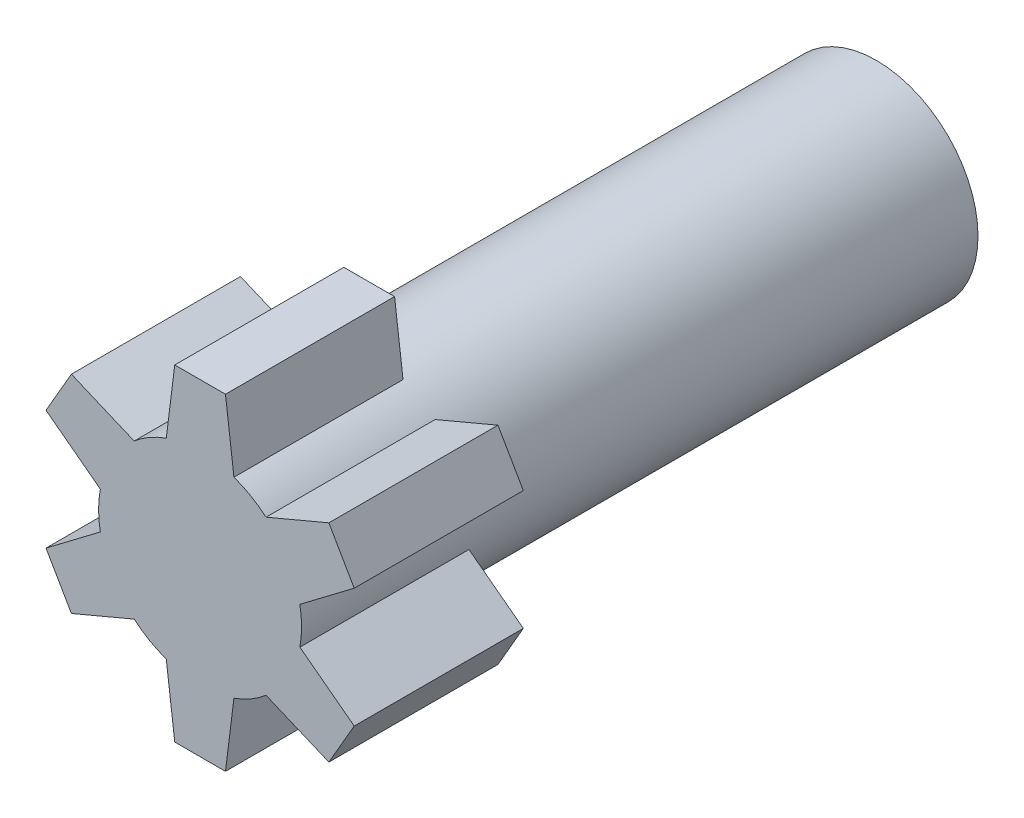
ISO-10303-21;
HEADER;
FILE_DESCRIPTION(('STEP AP214'),'2;1');
FILE_NAME('part.step','',(''),(''),'','','');
FILE_SCHEMA(('AUTOMOTIVE_DESIGN { 1 0 10303 214 1 1 1 1 }'));
ENDSEC;
DATA;
#1=APPLICATION_CONTEXT('core data for automotive mechanical design processes');
#2=APPLICATION_PROTOCOL_DEFINITION('international standard','automotive_design',2000,#1);
#3=PRODUCT_CONTEXT('',#1,'mechanical');
#4=PRODUCT('Part','Part','',(#3));
#5=PRODUCT_RELATED_PRODUCT_CATEGORY('part','',(#4));
#6=PRODUCT_DEFINITION_FORMATION('','',#4);
#7=PRODUCT_DEFINITION_CONTEXT('part definition',#1,'design');
#8=PRODUCT_DEFINITION('design','',#6,#7);
#9=PRODUCT_DEFINITION_SHAPE('','',#8);
#10=(LENGTH_UNIT() NAMED_UNIT(*) SI_UNIT(.MILLI.,.METRE.));
#11=(NAMED_UNIT(*) PLANE_ANGLE_UNIT() SI_UNIT($,.RADIAN.));
#12=(NAMED_UNIT(*) SI_UNIT($,.STERADIAN.) SOLID_ANGLE_UNIT());
#13=UNCERTAINTY_MEASURE_WITH_UNIT(LENGTH_MEASURE(1.E-05),#10,'distance_accuracy_value','');
#14=(GEOMETRIC_REPRESENTATION_CONTEXT(3) GLOBAL_UNCERTAINTY_ASSIGNED_CONTEXT((#13)) GLOBAL_UNIT_ASSIGNED_CONTEXT((#10,
#11,#12)) REPRESENTATION_CONTEXT('',''));
#15=CARTESIAN_POINT('',(0.,0.,0.));
#16=DIRECTION('',(0.,0.,1.));
#17=DIRECTION('',(1.,0.,0.));
#18=AXIS2_PLACEMENT_3D('',#15,#16,#17);
#19=CARTESIAN_POINT('',(0.,0.,0.));
#20=DIRECTION('',(0.,0.,1.));
#21=DIRECTION('',(1.,0.,0.));
#22=AXIS2_PLACEMENT_3D('',#19,#20,#21);
#23=PLANE('',#22);
#24=CARTESIAN_POINT('',(0.,0.,0.));
#25=DIRECTION('',(0.,0.,-1.));
#26=DIRECTION('',(-1.,0.,0.));
#27=AXIS2_PLACEMENT_3D('',#24,#25,#26);
#28=CIRCLE('',#27,3.);
#29=CARTESIAN_POINT('',(-2.94948974278318,0.548188158588649,0.));
#30=VERTEX_POINT('',#29);
#31=CARTESIAN_POINT('',(-1.94948974278318,2.28023896615753,0.));
#32=VERTEX_POINT('',#31);
#33=EDGE_CURVE('E44',#30,#32,#28,.T.);
#34=ORIENTED_EDGE('',*,*,#33,.F.);
#35=DIRECTION('',(-0.797320481552717,0.603556169462747,0.));
#36=VECTOR('',#35,1.);
#37=CARTESIAN_POINT('',(-4.55654055035206,1.76469450953475,0.));
#38=LINE('',#37,#36);
#39=CARTESIAN_POINT('',(-4.55654055035206,1.76469450953475,0.));
#40=VERTEX_POINT('',#39);
#41=EDGE_CURVE('E369',#30,#40,#38,.T.);
#42=ORIENTED_EDGE('',*,*,#41,.T.);
#43=DIRECTION('',(0.499999999999998,0.86602540378444,0.));
#44=VECTOR('',#43,1.);
#45=CARTESIAN_POINT('',(-3.80654055035206,3.06373261521141,0.));
#46=LINE('',#45,#44);
#47=CARTESIAN_POINT('',(-3.80654055035206,3.06373261521141,0.));
#48=VERTEX_POINT('',#47);
#49=EDGE_CURVE('E366',#40,#48,#46,.T.);
#50=ORIENTED_EDGE('',*,*,#49,.T.);
#51=DIRECTION('',(0.921355216141925,-0.388721707250917,0.));
#52=VECTOR('',#51,1.);
#53=CARTESIAN_POINT('',(-1.94948974278318,2.28023896615753,0.));
#54=LINE('',#53,#52);
#55=EDGE_CURVE('E363',#48,#32,#54,.T.);
#56=ORIENTED_EDGE('',*,*,#55,.T.);
#57=EDGE_LOOP('',(#34,#42,#50,#56));
#58=FACE_BOUND('',#57,.T.);
#59=ADVANCED_FACE('F33',(#58),#23,.F.);
#60=CARTESIAN_POINT('',(-1.,2.82842712474619,0.));
#61=VERTEX_POINT('',#60);
#62=CARTESIAN_POINT('',(1.,2.82842712474619,0.));
#63=VERTEX_POINT('',#62);
#64=EDGE_CURVE('E11',#61,#63,#28,.T.);
#65=ORIENTED_EDGE('',*,*,#64,.F.);
#66=DIRECTION('',(0.124034734589208,0.992277876713668,0.));
#67=VECTOR('',#66,1.);
#68=CARTESIAN_POINT('',(-0.75,4.82842712474619,0.));
#69=LINE('',#68,#67);
#70=CARTESIAN_POINT('',(-0.75,4.82842712474619,0.));
#71=VERTEX_POINT('',#70);
#72=EDGE_CURVE('E394',#61,#71,#69,.T.);
#73=ORIENTED_EDGE('',*,*,#72,.T.);
#74=DIRECTION('',(1.,0.,0.));
#75=VECTOR('',#74,1.);
#76=CARTESIAN_POINT('',(0.75,4.82842712474619,0.));
#77=LINE('',#76,#75);
#78=CARTESIAN_POINT('',(0.75,4.82842712474619,0.));
#79=VERTEX_POINT('',#78);
#80=EDGE_CURVE('E391',#71,#79,#77,.T.);
#81=ORIENTED_EDGE('',*,*,#80,.T.);
#82=DIRECTION('',(0.124034734589208,-0.992277876713668,0.));
#83=VECTOR('',#82,1.);
#84=CARTESIAN_POINT('',(1.,2.82842712474619,0.));
#85=LINE('',#84,#83);
#86=EDGE_CURVE('E388',#79,#63,#85,.T.);
#87=ORIENTED_EDGE('',*,*,#86,.T.);
#88=EDGE_LOOP('',(#65,#73,#81,#87));
#89=FACE_BOUND('',#88,.T.);
#90=ADVANCED_FACE('F429',(#89),#23,.F.);
#91=CARTESIAN_POINT('',(1.94948974278315,2.28023896615756,0.));
#92=VERTEX_POINT('',#91);
#93=CARTESIAN_POINT('',(2.94948974278317,0.548188158588694,0.));
#94=VERTEX_POINT('',#93);
#95=EDGE_CURVE('E42',#92,#94,#28,.T.);
#96=ORIENTED_EDGE('',*,*,#95,.F.);
#97=DIRECTION('',(0.921355216141919,0.38872170725093,0.));
#98=VECTOR('',#97,1.);
#99=CARTESIAN_POINT('',(3.80654055035202,3.06373261521147,0.));
#100=LINE('',#99,#98);
#101=CARTESIAN_POINT('',(3.80654055035202,3.06373261521147,0.));
#102=VERTEX_POINT('',#101);
#103=EDGE_CURVE('E270',#92,#102,#100,.T.);
#104=ORIENTED_EDGE('',*,*,#103,.T.);
#105=DIRECTION('',(0.500000000000011,-0.866025403784432,0.));
#106=VECTOR('',#105,1.);
#107=CARTESIAN_POINT('',(4.55654055035203,1.76469450953482,0.));
#108=LINE('',#107,#106);
#109=CARTESIAN_POINT('',(4.55654055035203,1.76469450953482,0.));
#110=VERTEX_POINT('',#109);
#111=EDGE_CURVE('E267',#102,#110,#108,.T.);
#112=ORIENTED_EDGE('',*,*,#111,.T.);
#113=DIRECTION('',(-0.797320481552708,-0.603556169462759,0.));
#114=VECTOR('',#113,1.);
#115=CARTESIAN_POINT('',(2.94948974278317,0.548188158588694,0.));
#116=LINE('',#115,#114);
#117=EDGE_CURVE('E264',#110,#94,#116,.T.);
#118=ORIENTED_EDGE('',*,*,#117,.T.);
#119=EDGE_LOOP('',(#96,#104,#112,#118));
#120=FACE_BOUND('',#119,.T.);
#121=ADVANCED_FACE('F458',(#120),#23,.F.);
#122=CARTESIAN_POINT('',(2.94948974278318,-0.548188158588627,0.));
#123=VERTEX_POINT('',#122);
#124=CARTESIAN_POINT('',(1.9494897427832,-2.28023896615751,0.));
#125=VERTEX_POINT('',#124);
#126=EDGE_CURVE('E505',#123,#125,#28,.T.);
#127=ORIENTED_EDGE('',*,*,#126,.F.);
#128=DIRECTION('',(0.797320481552721,-0.603556169462741,0.));
#129=VECTOR('',#128,1.);
#130=CARTESIAN_POINT('',(4.55654055035207,-1.76469450953472,0.));
#131=LINE('',#130,#129);
#132=CARTESIAN_POINT('',(4.55654055035207,-1.76469450953472,0.));
#133=VERTEX_POINT('',#132);
#134=EDGE_CURVE('E294',#123,#133,#131,.T.);
#135=ORIENTED_EDGE('',*,*,#134,.T.);
#136=DIRECTION('',(-0.499999999999991,-0.866025403784444,0.));
#137=VECTOR('',#136,1.);
#138=CARTESIAN_POINT('',(3.80654055035209,-3.06373261521139,0.));
#139=LINE('',#138,#137);
#140=CARTESIAN_POINT('',(3.80654055035209,-3.06373261521139,0.));
#141=VERTEX_POINT('',#140);
#142=EDGE_CURVE('E291',#133,#141,#139,.T.);
#143=ORIENTED_EDGE('',*,*,#142,.T.);
#144=DIRECTION('',(-0.921355216141928,0.38872170725091,0.));
#145=VECTOR('',#144,1.);
#146=CARTESIAN_POINT('',(1.9494897427832,-2.28023896615751,0.));
#147=LINE('',#146,#145);
#148=EDGE_CURVE('E288',#141,#125,#147,.T.);
#149=ORIENTED_EDGE('',*,*,#148,.T.);
#150=EDGE_LOOP('',(#127,#135,#143,#149));
#151=FACE_BOUND('',#150,.T.);
#152=ADVANCED_FACE('F466',(#151),#23,.F.);
#153=CARTESIAN_POINT('',(1.,-2.82842712474619,0.));
#154=VERTEX_POINT('',#153);
#155=CARTESIAN_POINT('',(-1.,-2.82842712474619,0.));
#156=VERTEX_POINT('',#155);
#157=EDGE_CURVE('E473',#154,#156,#28,.T.);
#158=ORIENTED_EDGE('',*,*,#157,.F.);
#159=DIRECTION('',(-0.124034734589208,-0.992277876713668,0.));
#160=VECTOR('',#159,1.);
#161=CARTESIAN_POINT('',(0.75,-4.82842712474619,0.));
#162=LINE('',#161,#160);
#163=CARTESIAN_POINT('',(0.75,-4.82842712474619,0.));
#164=VERTEX_POINT('',#163);
#165=EDGE_CURVE('E319',#154,#164,#162,.T.);
#166=ORIENTED_EDGE('',*,*,#165,.T.);
#167=DIRECTION('',(-1.,0.,0.));
#168=VECTOR('',#167,1.);
#169=CARTESIAN_POINT('',(-0.75,-4.82842712474619,0.));
#170=LINE('',#169,#168);
#171=CARTESIAN_POINT('',(-0.75,-4.82842712474619,0.));
#172=VERTEX_POINT('',#171);
#173=EDGE_CURVE('E316',#164,#172,#170,.T.);
#174=ORIENTED_EDGE('',*,*,#173,.T.);
#175=DIRECTION('',(-0.124034734589208,0.992277876713668,0.));
#176=VECTOR('',#175,1.);
#177=CARTESIAN_POINT('',(-1.,-2.82842712474619,0.));
#178=LINE('',#177,#176);
#179=EDGE_CURVE('E313',#172,#156,#178,.T.);
#180=ORIENTED_EDGE('',*,*,#179,.T.);
#181=EDGE_LOOP('',(#158,#166,#174,#180));
#182=FACE_BOUND('',#181,.T.);
#183=ADVANCED_FACE('F461',(#182),#23,.F.);
#184=CARTESIAN_POINT('',(-1.94948974278317,-2.28023896615754,0.));
#185=VERTEX_POINT('',#184);
#186=CARTESIAN_POINT('',(-2.94948974278318,-0.548188158588676,0.));
#187=VERTEX_POINT('',#186);
#188=EDGE_CURVE('E263',#185,#187,#28,.T.);
#189=ORIENTED_EDGE('',*,*,#188,.F.);
#190=DIRECTION('',(-0.921355216141922,-0.388721707250924,0.));
#191=VECTOR('',#190,1.);
#192=CARTESIAN_POINT('',(-3.80654055035204,-3.06373261521144,0.));
#193=LINE('',#192,#191);
#194=CARTESIAN_POINT('',(-3.80654055035204,-3.06373261521144,0.));
#195=VERTEX_POINT('',#194);
#196=EDGE_CURVE('E344',#185,#195,#193,.T.);
#197=ORIENTED_EDGE('',*,*,#196,.T.);
#198=DIRECTION('',(-0.500000000000004,0.866025403784436,0.));
#199=VECTOR('',#198,1.);
#200=CARTESIAN_POINT('',(-4.55654055035205,-1.76469450953479,0.));
#201=LINE('',#200,#199);
#202=CARTESIAN_POINT('',(-4.55654055035205,-1.76469450953479,0.));
#203=VERTEX_POINT('',#202);
#204=EDGE_CURVE('E341',#195,#203,#201,.T.);
#205=ORIENTED_EDGE('',*,*,#204,.T.);
#206=DIRECTION('',(0.797320481552712,0.603556169462753,0.));
#207=VECTOR('',#206,1.);
#208=CARTESIAN_POINT('',(-2.94948974278318,-0.548188158588672,0.));
#209=LINE('',#208,#207);
#210=EDGE_CURVE('E338',#203,#187,#209,.T.);
#211=ORIENTED_EDGE('',*,*,#210,.T.);
#212=EDGE_LOOP('',(#189,#197,#205,#211));
#213=FACE_BOUND('',#212,.T.);
#214=ADVANCED_FACE('F435',(#213),#23,.F.);
#215=CARTESIAN_POINT('',(0.,0.,5.));
#216=DIRECTION('',(0.,0.,-1.));
#217=DIRECTION('',(-1.,0.,0.));
#218=AXIS2_PLACEMENT_3D('',#215,#216,#217);
#219=CYLINDRICAL_SURFACE('',#218,3.);
#220=DIRECTION('',(0.,0.,1.));
#221=VECTOR('',#220,1.);
#222=CARTESIAN_POINT('',(-1.,2.82842712474619,-2.82842712474619));
#223=LINE('',#222,#221);
#224=CARTESIAN_POINT('',(-1.,2.82842712474619,5.));
#225=VERTEX_POINT('',#224);
#226=EDGE_CURVE('E404',#61,#225,#223,.T.);
#227=ORIENTED_EDGE('',*,*,#226,.F.);
#228=ORIENTED_EDGE('',*,*,#64,.T.);
#229=DIRECTION('',(0.,0.,1.));
#230=VECTOR('',#229,1.);
#231=CARTESIAN_POINT('',(1.,2.82842712474619,-2.82842712474619));
#232=LINE('',#231,#230);
#233=CARTESIAN_POINT('',(1.,2.82842712474619,5.));
#234=VERTEX_POINT('',#233);
#235=EDGE_CURVE('E408',#63,#234,#232,.T.);
#236=ORIENTED_EDGE('',*,*,#235,.T.);
#237=CARTESIAN_POINT('',(0.,0.,5.));
#238=DIRECTION('',(0.,0.,1.));
#239=DIRECTION('',(1.,0.,0.));
#240=AXIS2_PLACEMENT_3D('',#237,#238,#239);
#241=CIRCLE('',#240,3.);
#242=CARTESIAN_POINT('',(1.94948974278315,2.28023896615756,5.));
#243=VERTEX_POINT('',#242);
#244=EDGE_CURVE('E59',#243,#234,#241,.T.);
#245=ORIENTED_EDGE('',*,*,#244,.F.);
#246=DIRECTION('',(0.,0.,1.));
#247=VECTOR('',#246,1.);
#248=CARTESIAN_POINT('',(1.94948974278315,2.28023896615756,-3.62279972210598));
#249=LINE('',#248,#247);
#250=EDGE_CURVE('E281',#92,#243,#249,.T.);
#251=ORIENTED_EDGE('',*,*,#250,.F.);
#252=ORIENTED_EDGE('',*,*,#95,.T.);
#253=DIRECTION('',(0.,0.,1.));
#254=VECTOR('',#253,1.);
#255=CARTESIAN_POINT('',(2.94948974278317,0.548188158588694,-3.62279972210598));
#256=LINE('',#255,#254);
#257=CARTESIAN_POINT('',(2.94948974278317,0.548188158588693,5.));
#258=VERTEX_POINT('',#257);
#259=EDGE_CURVE('E285',#94,#258,#256,.T.);
#260=ORIENTED_EDGE('',*,*,#259,.T.);
#261=CARTESIAN_POINT('',(2.94948974278318,-0.548188158588626,5.));
#262=VERTEX_POINT('',#261);
#263=EDGE_CURVE('E494',#262,#258,#241,.T.);
#264=ORIENTED_EDGE('',*,*,#263,.F.);
#265=DIRECTION('',(0.,0.,1.));
#266=VECTOR('',#265,1.);
#267=CARTESIAN_POINT('',(2.94948974278318,-0.548188158588627,-3.62279972210596));
#268=LINE('',#267,#266);
#269=EDGE_CURVE('E305',#123,#262,#268,.T.);
#270=ORIENTED_EDGE('',*,*,#269,.F.);
#271=ORIENTED_EDGE('',*,*,#126,.T.);
#272=DIRECTION('',(0.,0.,1.));
#273=VECTOR('',#272,1.);
#274=CARTESIAN_POINT('',(1.9494897427832,-2.28023896615751,-3.62279972210596));
#275=LINE('',#274,#273);
#276=CARTESIAN_POINT('',(1.9494897427832,-2.28023896615751,5.));
#277=VERTEX_POINT('',#276);
#278=EDGE_CURVE('E309',#125,#277,#275,.T.);
#279=ORIENTED_EDGE('',*,*,#278,.T.);
#280=CARTESIAN_POINT('',(1.,-2.82842712474619,5.));
#281=VERTEX_POINT('',#280);
#282=EDGE_CURVE('E491',#281,#277,#241,.T.);
#283=ORIENTED_EDGE('',*,*,#282,.F.);
#284=DIRECTION('',(0.,0.,1.));
#285=VECTOR('',#284,1.);
#286=CARTESIAN_POINT('',(1.,-2.82842712474619,-2.82842712474619));
#287=LINE('',#286,#285);
#288=EDGE_CURVE('E330',#154,#281,#287,.T.);
#289=ORIENTED_EDGE('',*,*,#288,.F.);
#290=ORIENTED_EDGE('',*,*,#157,.T.);
#291=DIRECTION('',(0.,0.,1.));
#292=VECTOR('',#291,1.);
#293=CARTESIAN_POINT('',(-1.,-2.82842712474619,-2.82842712474619));
#294=LINE('',#293,#292);
#295=CARTESIAN_POINT('',(-1.,-2.82842712474619,5.));
#296=VERTEX_POINT('',#295);
#297=EDGE_CURVE('E334',#156,#296,#294,.T.);
#298=ORIENTED_EDGE('',*,*,#297,.T.);
#299=CARTESIAN_POINT('',(-1.94948974278317,-2.28023896615754,5.));
#300=VERTEX_POINT('',#299);
#301=EDGE_CURVE('E475',#300,#296,#241,.T.);
#302=ORIENTED_EDGE('',*,*,#301,.F.);
#303=DIRECTION('',(0.,0.,1.));
#304=VECTOR('',#303,1.);
#305=CARTESIAN_POINT('',(-1.94948974278317,-2.28023896615754,-3.62279972210597));
#306=LINE('',#305,#304);
#307=EDGE_CURVE('E355',#185,#300,#306,.T.);
#308=ORIENTED_EDGE('',*,*,#307,.F.);
#309=ORIENTED_EDGE('',*,*,#188,.T.);
#310=DIRECTION('',(0.,0.,1.));
#311=VECTOR('',#310,1.);
#312=CARTESIAN_POINT('',(-2.94948974278318,-0.548188158588672,-3.62279972210597));
#313=LINE('',#312,#311);
#314=CARTESIAN_POINT('',(-2.94948974278318,-0.548188158588676,5.));
#315=VERTEX_POINT('',#314);
#316=EDGE_CURVE('E359',#187,#315,#313,.T.);
#317=ORIENTED_EDGE('',*,*,#316,.T.);
#318=CARTESIAN_POINT('',(-2.94948974278318,0.548188158588649,5.));
#319=VERTEX_POINT('',#318);
#320=EDGE_CURVE('E489',#319,#315,#241,.T.);
#321=ORIENTED_EDGE('',*,*,#320,.F.);
#322=DIRECTION('',(0.,0.,1.));
#323=VECTOR('',#322,1.);
#324=CARTESIAN_POINT('',(-2.94948974278318,0.548188158588649,-3.62279972210596));
#325=LINE('',#324,#323);
#326=EDGE_CURVE('E380',#30,#319,#325,.T.);
#327=ORIENTED_EDGE('',*,*,#326,.F.);
#328=ORIENTED_EDGE('',*,*,#33,.T.);
#329=DIRECTION('',(0.,0.,1.));
#330=VECTOR('',#329,1.);
#331=CARTESIAN_POINT('',(-1.94948974278318,2.28023896615753,-3.62279972210596));
#332=LINE('',#331,#330);
#333=CARTESIAN_POINT('',(-1.94948974278318,2.28023896615753,5.));
#334=VERTEX_POINT('',#333);
#335=EDGE_CURVE('E384',#32,#334,#332,.T.);
#336=ORIENTED_EDGE('',*,*,#335,.T.);
#337=EDGE_CURVE('E37',#225,#334,#241,.T.);
#338=ORIENTED_EDGE('',*,*,#337,.F.);
#339=EDGE_LOOP('',(#227,#228,#236,#245,#251,#252,#260,#264,#270,#271,#279,#283,#289,#290,#298,
#302,#308,#309,#317,#321,#327,#328,#336,#338));
#340=FACE_BOUND('',#339,.T.);
#341=CARTESIAN_POINT('',(0.,0.,-15.));
#342=DIRECTION('',(0.,0.,-1.));
#343=DIRECTION('',(-1.,0.,0.));
#344=AXIS2_PLACEMENT_3D('',#341,#342,#343);
#345=CIRCLE('',#344,3.);
#346=CARTESIAN_POINT('',(-3.,0.,-15.));
#347=VERTEX_POINT('',#346);
#348=EDGE_CURVE('E259',#347,#347,#345,.T.);
#349=ORIENTED_EDGE('',*,*,#348,.F.);
#350=EDGE_LOOP('',(#349));
#351=FACE_BOUND('',#350,.T.);
#352=ADVANCED_FACE('F35',(#340,#351),#219,.T.);
#353=CARTESIAN_POINT('',(0.,0.,5.));
#354=DIRECTION('',(0.,0.,1.));
#355=DIRECTION('',(1.,0.,0.));
#356=AXIS2_PLACEMENT_3D('',#353,#354,#355);
#357=PLANE('',#356);
#358=ORIENTED_EDGE('',*,*,#263,.T.);
#359=DIRECTION('',(0.797320481552708,0.603556169462759,0.));
#360=VECTOR('',#359,1.);
#361=CARTESIAN_POINT('',(2.94948974278317,0.548188158588694,5.));
#362=LINE('',#361,#360);
#363=CARTESIAN_POINT('',(4.55654055035203,1.76469450953482,5.));
#364=VERTEX_POINT('',#363);
#365=EDGE_CURVE('E275',#258,#364,#362,.T.);
#366=ORIENTED_EDGE('',*,*,#365,.T.);
#367=DIRECTION('',(-0.500000000000011,0.866025403784432,0.));
#368=VECTOR('',#367,1.);
#369=CARTESIAN_POINT('',(4.55654055035203,1.76469450953482,5.));
#370=LINE('',#369,#368);
#371=CARTESIAN_POINT('',(3.80654055035202,3.06373261521147,5.));
#372=VERTEX_POINT('',#371);
#373=EDGE_CURVE('E278',#364,#372,#370,.T.);
#374=ORIENTED_EDGE('',*,*,#373,.T.);
#375=DIRECTION('',(-0.921355216141919,-0.38872170725093,0.));
#376=VECTOR('',#375,1.);
#377=CARTESIAN_POINT('',(3.80654055035202,3.06373261521147,5.));
#378=LINE('',#377,#376);
#379=EDGE_CURVE('E261',#372,#243,#378,.T.);
#380=ORIENTED_EDGE('',*,*,#379,.T.);
#381=ORIENTED_EDGE('',*,*,#244,.T.);
#382=DIRECTION('',(-0.124034734589208,0.992277876713668,0.));
#383=VECTOR('',#382,1.);
#384=CARTESIAN_POINT('',(1.,2.82842712474619,5.));
#385=LINE('',#384,#383);
#386=CARTESIAN_POINT('',(0.75,4.82842712474619,5.));
#387=VERTEX_POINT('',#386);
#388=EDGE_CURVE('E398',#234,#387,#385,.T.);
#389=ORIENTED_EDGE('',*,*,#388,.T.);
#390=DIRECTION('',(-1.,0.,0.));
#391=VECTOR('',#390,1.);
#392=CARTESIAN_POINT('',(0.75,4.82842712474619,5.));
#393=LINE('',#392,#391);
#394=CARTESIAN_POINT('',(-0.75,4.82842712474619,5.));
#395=VERTEX_POINT('',#394);
#396=EDGE_CURVE('E401',#387,#395,#393,.T.);
#397=ORIENTED_EDGE('',*,*,#396,.T.);
#398=DIRECTION('',(-0.124034734589208,-0.992277876713668,0.));
#399=VECTOR('',#398,1.);
#400=CARTESIAN_POINT('',(-0.75,4.82842712474619,5.));
#401=LINE('',#400,#399);
#402=EDGE_CURVE('E371',#395,#225,#401,.T.);
#403=ORIENTED_EDGE('',*,*,#402,.T.);
#404=ORIENTED_EDGE('',*,*,#337,.T.);
#405=DIRECTION('',(-0.921355216141925,0.388721707250916,0.));
#406=VECTOR('',#405,1.);
#407=CARTESIAN_POINT('',(-1.94948974278318,2.28023896615753,5.));
#408=LINE('',#407,#406);
#409=CARTESIAN_POINT('',(-3.80654055035206,3.06373261521141,5.));
#410=VERTEX_POINT('',#409);
#411=EDGE_CURVE('E374',#334,#410,#408,.T.);
#412=ORIENTED_EDGE('',*,*,#411,.T.);
#413=DIRECTION('',(-0.499999999999998,-0.86602540378444,0.));
#414=VECTOR('',#413,1.);
#415=CARTESIAN_POINT('',(-3.80654055035206,3.06373261521141,5.));
#416=LINE('',#415,#414);
#417=CARTESIAN_POINT('',(-4.55654055035206,1.76469450953475,5.));
#418=VERTEX_POINT('',#417);
#419=EDGE_CURVE('E377',#410,#418,#416,.T.);
#420=ORIENTED_EDGE('',*,*,#419,.T.);
#421=DIRECTION('',(0.797320481552717,-0.603556169462747,0.));
#422=VECTOR('',#421,1.);
#423=CARTESIAN_POINT('',(-4.55654055035206,1.76469450953475,5.));
#424=LINE('',#423,#422);
#425=EDGE_CURVE('E346',#418,#319,#424,.T.);
#426=ORIENTED_EDGE('',*,*,#425,.T.);
#427=ORIENTED_EDGE('',*,*,#320,.T.);
#428=DIRECTION('',(-0.797320481552712,-0.603556169462753,0.));
#429=VECTOR('',#428,1.);
#430=CARTESIAN_POINT('',(-2.94948974278318,-0.548188158588672,5.));
#431=LINE('',#430,#429);
#432=CARTESIAN_POINT('',(-4.55654055035205,-1.76469450953479,5.));
#433=VERTEX_POINT('',#432);
#434=EDGE_CURVE('E349',#315,#433,#431,.T.);
#435=ORIENTED_EDGE('',*,*,#434,.T.);
#436=DIRECTION('',(0.500000000000004,-0.866025403784436,0.));
#437=VECTOR('',#436,1.);
#438=CARTESIAN_POINT('',(-4.55654055035205,-1.76469450953479,5.));
#439=LINE('',#438,#437);
#440=CARTESIAN_POINT('',(-3.80654055035204,-3.06373261521144,5.));
#441=VERTEX_POINT('',#440);
#442=EDGE_CURVE('E352',#433,#441,#439,.T.);
#443=ORIENTED_EDGE('',*,*,#442,.T.);
#444=DIRECTION('',(0.921355216141922,0.388721707250924,0.));
#445=VECTOR('',#444,1.);
#446=CARTESIAN_POINT('',(-3.80654055035204,-3.06373261521144,5.));
#447=LINE('',#446,#445);
#448=EDGE_CURVE('E321',#441,#300,#447,.T.);
#449=ORIENTED_EDGE('',*,*,#448,.T.);
#450=ORIENTED_EDGE('',*,*,#301,.T.);
#451=DIRECTION('',(0.124034734589208,-0.992277876713668,0.));
#452=VECTOR('',#451,1.);
#453=CARTESIAN_POINT('',(-1.,-2.82842712474619,5.));
#454=LINE('',#453,#452);
#455=CARTESIAN_POINT('',(-0.75,-4.82842712474619,5.));
#456=VERTEX_POINT('',#455);
#457=EDGE_CURVE('E324',#296,#456,#454,.T.);
#458=ORIENTED_EDGE('',*,*,#457,.T.);
#459=DIRECTION('',(1.,0.,0.));
#460=VECTOR('',#459,1.);
#461=CARTESIAN_POINT('',(-0.75,-4.82842712474619,5.));
#462=LINE('',#461,#460);
#463=CARTESIAN_POINT('',(0.75,-4.82842712474619,5.));
#464=VERTEX_POINT('',#463);
#465=EDGE_CURVE('E327',#456,#464,#462,.T.);
#466=ORIENTED_EDGE('',*,*,#465,.T.);
#467=DIRECTION('',(0.124034734589208,0.992277876713668,0.));
#468=VECTOR('',#467,1.);
#469=CARTESIAN_POINT('',(0.75,-4.82842712474619,5.));
#470=LINE('',#469,#468);
#471=EDGE_CURVE('E296',#464,#281,#470,.T.);
#472=ORIENTED_EDGE('',*,*,#471,.T.);
#473=ORIENTED_EDGE('',*,*,#282,.T.);
#474=DIRECTION('',(0.921355216141928,-0.388721707250909,0.));
#475=VECTOR('',#474,1.);
#476=CARTESIAN_POINT('',(1.9494897427832,-2.28023896615751,5.));
#477=LINE('',#476,#475);
#478=CARTESIAN_POINT('',(3.80654055035209,-3.06373261521139,5.));
#479=VERTEX_POINT('',#478);
#480=EDGE_CURVE('E299',#277,#479,#477,.T.);
#481=ORIENTED_EDGE('',*,*,#480,.T.);
#482=DIRECTION('',(0.499999999999991,0.866025403784444,0.));
#483=VECTOR('',#482,1.);
#484=CARTESIAN_POINT('',(3.80654055035209,-3.06373261521139,5.));
#485=LINE('',#484,#483);
#486=CARTESIAN_POINT('',(4.55654055035207,-1.76469450953472,5.));
#487=VERTEX_POINT('',#486);
#488=EDGE_CURVE('E302',#479,#487,#485,.T.);
#489=ORIENTED_EDGE('',*,*,#488,.T.);
#490=DIRECTION('',(-0.797320481552721,0.603556169462741,0.));
#491=VECTOR('',#490,1.);
#492=CARTESIAN_POINT('',(4.55654055035207,-1.76469450953472,5.));
#493=LINE('',#492,#491);
#494=EDGE_CURVE('E272',#487,#262,#493,.T.);
#495=ORIENTED_EDGE('',*,*,#494,.T.);
#496=EDGE_LOOP('',(#358,#366,#374,#380,#381,#389,#397,#403,#404,#412,#420,#426,#427,#435,#443,
#449,#450,#458,#466,#472,#473,#481,#489,#495));
#497=FACE_BOUND('',#496,.T.);
#498=ADVANCED_FACE('F419',(#497),#357,.T.);
#499=CARTESIAN_POINT('',(-0.75,4.82842712474619,-2.82842712474619));
#500=DIRECTION('',(-0.992277876713668,0.124034734589208,0.));
#501=DIRECTION('',(-0.124034734589208,-0.992277876713668,0.));
#502=AXIS2_PLACEMENT_3D('',#499,#500,#501);
#503=PLANE('',#502);
#504=ORIENTED_EDGE('',*,*,#72,.F.);
#505=ORIENTED_EDGE('',*,*,#226,.T.);
#506=ORIENTED_EDGE('',*,*,#402,.F.);
#507=DIRECTION('',(0.,0.,1.));
#508=VECTOR('',#507,1.);
#509=CARTESIAN_POINT('',(-0.75,4.82842712474619,-2.82842712474619));
#510=LINE('',#509,#508);
#511=EDGE_CURVE('E392',#71,#395,#510,.T.);
#512=ORIENTED_EDGE('',*,*,#511,.F.);
#513=EDGE_LOOP('',(#504,#505,#506,#512));
#514=FACE_BOUND('',#513,.T.);
#515=ADVANCED_FACE('F414',(#514),#503,.T.);
#516=CARTESIAN_POINT('',(0.75,4.82842712474619,-2.82842712474619));
#517=DIRECTION('',(0.,1.,0.));
#518=DIRECTION('',(0.,0.,1.));
#519=AXIS2_PLACEMENT_3D('',#516,#517,#518);
#520=PLANE('',#519);
#521=ORIENTED_EDGE('',*,*,#80,.F.);
#522=ORIENTED_EDGE('',*,*,#511,.T.);
#523=ORIENTED_EDGE('',*,*,#396,.F.);
#524=DIRECTION('',(0.,0.,1.));
#525=VECTOR('',#524,1.);
#526=CARTESIAN_POINT('',(0.75,4.82842712474619,-2.82842712474619));
#527=LINE('',#526,#525);
#528=EDGE_CURVE('E406',#79,#387,#527,.T.);
#529=ORIENTED_EDGE('',*,*,#528,.F.);
#530=EDGE_LOOP('',(#521,#522,#523,#529));
#531=FACE_BOUND('',#530,.T.);
#532=ADVANCED_FACE('F426',(#531),#520,.T.);
#533=CARTESIAN_POINT('',(1.,2.82842712474619,-2.82842712474619));
#534=DIRECTION('',(0.992277876713668,0.124034734589208,0.));
#535=DIRECTION('',(-0.124034734589208,0.992277876713668,0.));
#536=AXIS2_PLACEMENT_3D('',#533,#534,#535);
#537=PLANE('',#536);
#538=ORIENTED_EDGE('',*,*,#86,.F.);
#539=ORIENTED_EDGE('',*,*,#528,.T.);
#540=ORIENTED_EDGE('',*,*,#388,.F.);
#541=ORIENTED_EDGE('',*,*,#235,.F.);
#542=EDGE_LOOP('',(#538,#539,#540,#541));
#543=FACE_BOUND('',#542,.T.);
#544=ADVANCED_FACE('F432',(#543),#537,.T.);
#545=CARTESIAN_POINT('',(-4.55654055035206,1.76469450953475,-3.62279972210596));
#546=DIRECTION('',(-0.603556169462747,-0.797320481552717,0.));
#547=DIRECTION('',(0.797320481552717,-0.603556169462747,0.));
#548=AXIS2_PLACEMENT_3D('',#545,#546,#547);
#549=PLANE('',#548);
#550=ORIENTED_EDGE('',*,*,#41,.F.);
#551=ORIENTED_EDGE('',*,*,#326,.T.);
#552=ORIENTED_EDGE('',*,*,#425,.F.);
#553=DIRECTION('',(0.,0.,1.));
#554=VECTOR('',#553,1.);
#555=CARTESIAN_POINT('',(-4.55654055035206,1.76469450953475,-3.62279972210596));
#556=LINE('',#555,#554);
#557=EDGE_CURVE('E367',#40,#418,#556,.T.);
#558=ORIENTED_EDGE('',*,*,#557,.F.);
#559=EDGE_LOOP('',(#550,#551,#552,#558));
#560=FACE_BOUND('',#559,.T.);
#561=ADVANCED_FACE('F550',(#560),#549,.T.);
#562=CARTESIAN_POINT('',(-3.80654055035206,3.06373261521141,-3.62279972210596));
#563=DIRECTION('',(-0.86602540378444,0.499999999999998,0.));
#564=DIRECTION('',(-0.499999999999998,-0.86602540378444,0.));
#565=AXIS2_PLACEMENT_3D('',#562,#563,#564);
#566=PLANE('',#565);
#567=ORIENTED_EDGE('',*,*,#49,.F.);
#568=ORIENTED_EDGE('',*,*,#557,.T.);
#569=ORIENTED_EDGE('',*,*,#419,.F.);
#570=DIRECTION('',(0.,0.,1.));
#571=VECTOR('',#570,1.);
#572=CARTESIAN_POINT('',(-3.80654055035206,3.06373261521141,-3.62279972210596));
#573=LINE('',#572,#571);
#574=EDGE_CURVE('E382',#48,#410,#573,.T.);
#575=ORIENTED_EDGE('',*,*,#574,.F.);
#576=EDGE_LOOP('',(#567,#568,#569,#575));
#577=FACE_BOUND('',#576,.T.);
#578=ADVANCED_FACE('F547',(#577),#566,.T.);
#579=CARTESIAN_POINT('',(-1.94948974278318,2.28023896615753,-3.62279972210596));
#580=DIRECTION('',(0.388721707250916,0.921355216141925,0.));
#581=DIRECTION('',(-0.921355216141925,0.388721707250917,0.));
#582=AXIS2_PLACEMENT_3D('',#579,#580,#581);
#583=PLANE('',#582);
#584=ORIENTED_EDGE('',*,*,#55,.F.);
#585=ORIENTED_EDGE('',*,*,#574,.T.);
#586=ORIENTED_EDGE('',*,*,#411,.F.);
#587=ORIENTED_EDGE('',*,*,#335,.F.);
#588=EDGE_LOOP('',(#584,#585,#586,#587));
#589=FACE_BOUND('',#588,.T.);
#590=ADVANCED_FACE('F546',(#589),#583,.T.);
#591=CARTESIAN_POINT('',(-3.80654055035204,-3.06373261521144,-3.62279972210597));
#592=DIRECTION('',(0.388721707250924,-0.921355216141922,0.));
#593=DIRECTION('',(0.921355216141922,0.388721707250924,0.));
#594=AXIS2_PLACEMENT_3D('',#591,#592,#593);
#595=PLANE('',#594);
#596=ORIENTED_EDGE('',*,*,#196,.F.);
#597=ORIENTED_EDGE('',*,*,#307,.T.);
#598=ORIENTED_EDGE('',*,*,#448,.F.);
#599=DIRECTION('',(0.,0.,1.));
#600=VECTOR('',#599,1.);
#601=CARTESIAN_POINT('',(-3.80654055035204,-3.06373261521144,-3.62279972210597));
#602=LINE('',#601,#600);
#603=EDGE_CURVE('E342',#195,#441,#602,.T.);
#604=ORIENTED_EDGE('',*,*,#603,.F.);
#605=EDGE_LOOP('',(#596,#597,#598,#604));
#606=FACE_BOUND('',#605,.T.);
#607=ADVANCED_FACE('F479',(#606),#595,.T.);
#608=CARTESIAN_POINT('',(-4.55654055035205,-1.76469450953479,-3.62279972210597));
#609=DIRECTION('',(-0.866025403784436,-0.500000000000004,0.));
#610=DIRECTION('',(0.500000000000004,-0.866025403784436,0.));
#611=AXIS2_PLACEMENT_3D('',#608,#609,#610);
#612=PLANE('',#611);
#613=ORIENTED_EDGE('',*,*,#204,.F.);
#614=ORIENTED_EDGE('',*,*,#603,.T.);
#615=ORIENTED_EDGE('',*,*,#442,.F.);
#616=DIRECTION('',(0.,0.,1.));
#617=VECTOR('',#616,1.);
#618=CARTESIAN_POINT('',(-4.55654055035205,-1.76469450953479,-3.62279972210597));
#619=LINE('',#618,#617);
#620=EDGE_CURVE('E357',#203,#433,#619,.T.);
#621=ORIENTED_EDGE('',*,*,#620,.F.);
#622=EDGE_LOOP('',(#613,#614,#615,#621));
#623=FACE_BOUND('',#622,.T.);
#624=ADVANCED_FACE('F482',(#623),#612,.T.);
#625=CARTESIAN_POINT('',(-2.94948974278318,-0.548188158588672,-3.62279972210597));
#626=DIRECTION('',(-0.603556169462753,0.797320481552712,0.));
#627=DIRECTION('',(-0.797320481552712,-0.603556169462753,0.));
#628=AXIS2_PLACEMENT_3D('',#625,#626,#627);
#629=PLANE('',#628);
#630=ORIENTED_EDGE('',*,*,#210,.F.);
#631=ORIENTED_EDGE('',*,*,#620,.T.);
#632=ORIENTED_EDGE('',*,*,#434,.F.);
#633=ORIENTED_EDGE('',*,*,#316,.F.);
#634=EDGE_LOOP('',(#630,#631,#632,#633));
#635=FACE_BOUND('',#634,.T.);
#636=ADVANCED_FACE('F485',(#635),#629,.T.);
#637=CARTESIAN_POINT('',(0.75,-4.82842712474619,-2.82842712474619));
#638=DIRECTION('',(0.992277876713668,-0.124034734589208,0.));
#639=DIRECTION('',(0.124034734589208,0.992277876713668,0.));
#640=AXIS2_PLACEMENT_3D('',#637,#638,#639);
#641=PLANE('',#640);
#642=ORIENTED_EDGE('',*,*,#165,.F.);
#643=ORIENTED_EDGE('',*,*,#288,.T.);
#644=ORIENTED_EDGE('',*,*,#471,.F.);
#645=DIRECTION('',(0.,0.,1.));
#646=VECTOR('',#645,1.);
#647=CARTESIAN_POINT('',(0.75,-4.82842712474619,-2.82842712474619));
#648=LINE('',#647,#646);
#649=EDGE_CURVE('E317',#164,#464,#648,.T.);
#650=ORIENTED_EDGE('',*,*,#649,.F.);
#651=EDGE_LOOP('',(#642,#643,#644,#650));
#652=FACE_BOUND('',#651,.T.);
#653=ADVANCED_FACE('F532',(#652),#641,.T.);
#654=CARTESIAN_POINT('',(-0.75,-4.82842712474619,-2.82842712474619));
#655=DIRECTION('',(0.,-1.,0.));
#656=DIRECTION('',(0.,0.,-1.));
#657=AXIS2_PLACEMENT_3D('',#654,#655,#656);
#658=PLANE('',#657);
#659=ORIENTED_EDGE('',*,*,#173,.F.);
#660=ORIENTED_EDGE('',*,*,#649,.T.);
#661=ORIENTED_EDGE('',*,*,#465,.F.);
#662=DIRECTION('',(0.,0.,1.));
#663=VECTOR('',#662,1.);
#664=CARTESIAN_POINT('',(-0.75,-4.82842712474619,-2.82842712474619));
#665=LINE('',#664,#663);
#666=EDGE_CURVE('E332',#172,#456,#665,.T.);
#667=ORIENTED_EDGE('',*,*,#666,.F.);
#668=EDGE_LOOP('',(#659,#660,#661,#667));
#669=FACE_BOUND('',#668,.T.);
#670=ADVANCED_FACE('F529',(#669),#658,.T.);
#671=CARTESIAN_POINT('',(-1.,-2.82842712474619,-2.82842712474619));
#672=DIRECTION('',(-0.992277876713668,-0.124034734589208,0.));
#673=DIRECTION('',(0.124034734589208,-0.992277876713668,0.));
#674=AXIS2_PLACEMENT_3D('',#671,#672,#673);
#675=PLANE('',#674);
#676=ORIENTED_EDGE('',*,*,#179,.F.);
#677=ORIENTED_EDGE('',*,*,#666,.T.);
#678=ORIENTED_EDGE('',*,*,#457,.F.);
#679=ORIENTED_EDGE('',*,*,#297,.F.);
#680=EDGE_LOOP('',(#676,#677,#678,#679));
#681=FACE_BOUND('',#680,.T.);
#682=ADVANCED_FACE('F527',(#681),#675,.T.);
#683=CARTESIAN_POINT('',(4.55654055035207,-1.76469450953472,-3.62279972210596));
#684=DIRECTION('',(0.603556169462741,0.797320481552722,0.));
#685=DIRECTION('',(-0.797320481552721,0.603556169462741,0.));
#686=AXIS2_PLACEMENT_3D('',#683,#684,#685);
#687=PLANE('',#686);
#688=ORIENTED_EDGE('',*,*,#134,.F.);
#689=ORIENTED_EDGE('',*,*,#269,.T.);
#690=ORIENTED_EDGE('',*,*,#494,.F.);
#691=DIRECTION('',(0.,0.,1.));
#692=VECTOR('',#691,1.);
#693=CARTESIAN_POINT('',(4.55654055035207,-1.76469450953472,-3.62279972210596));
#694=LINE('',#693,#692);
#695=EDGE_CURVE('E292',#133,#487,#694,.T.);
#696=ORIENTED_EDGE('',*,*,#695,.F.);
#697=EDGE_LOOP('',(#688,#689,#690,#696));
#698=FACE_BOUND('',#697,.T.);
#699=ADVANCED_FACE('F520',(#698),#687,.T.);
#700=CARTESIAN_POINT('',(3.80654055035209,-3.06373261521139,-3.62279972210596));
#701=DIRECTION('',(0.866025403784444,-0.499999999999991,0.));
#702=DIRECTION('',(0.499999999999991,0.866025403784444,0.));
#703=AXIS2_PLACEMENT_3D('',#700,#701,#702);
#704=PLANE('',#703);
#705=ORIENTED_EDGE('',*,*,#142,.F.);
#706=ORIENTED_EDGE('',*,*,#695,.T.);
#707=ORIENTED_EDGE('',*,*,#488,.F.);
#708=DIRECTION('',(0.,0.,1.));
#709=VECTOR('',#708,1.);
#710=CARTESIAN_POINT('',(3.80654055035209,-3.06373261521139,-3.62279972210596));
#711=LINE('',#710,#709);
#712=EDGE_CURVE('E307',#141,#479,#711,.T.);
#713=ORIENTED_EDGE('',*,*,#712,.F.);
#714=EDGE_LOOP('',(#705,#706,#707,#713));
#715=FACE_BOUND('',#714,.T.);
#716=ADVANCED_FACE('F517',(#715),#704,.T.);
#717=CARTESIAN_POINT('',(1.9494897427832,-2.28023896615751,-3.62279972210596));
#718=DIRECTION('',(-0.38872170725091,-0.921355216141928,0.));
#719=DIRECTION('',(0.921355216141928,-0.38872170725091,0.));
#720=AXIS2_PLACEMENT_3D('',#717,#718,#719);
#721=PLANE('',#720);
#722=ORIENTED_EDGE('',*,*,#148,.F.);
#723=ORIENTED_EDGE('',*,*,#712,.T.);
#724=ORIENTED_EDGE('',*,*,#480,.F.);
#725=ORIENTED_EDGE('',*,*,#278,.F.);
#726=EDGE_LOOP('',(#722,#723,#724,#725));
#727=FACE_BOUND('',#726,.T.);
#728=ADVANCED_FACE('F514',(#727),#721,.T.);
#729=CARTESIAN_POINT('',(3.80654055035202,3.06373261521147,-3.62279972210598));
#730=DIRECTION('',(-0.38872170725093,0.921355216141919,0.));
#731=DIRECTION('',(-0.921355216141919,-0.38872170725093,0.));
#732=AXIS2_PLACEMENT_3D('',#729,#730,#731);
#733=PLANE('',#732);
#734=ORIENTED_EDGE('',*,*,#103,.F.);
#735=ORIENTED_EDGE('',*,*,#250,.T.);
#736=ORIENTED_EDGE('',*,*,#379,.F.);
#737=DIRECTION('',(0.,0.,1.));
#738=VECTOR('',#737,1.);
#739=CARTESIAN_POINT('',(3.80654055035202,3.06373261521147,-3.62279972210598));
#740=LINE('',#739,#738);
#741=EDGE_CURVE('E268',#102,#372,#740,.T.);
#742=ORIENTED_EDGE('',*,*,#741,.F.);
#743=EDGE_LOOP('',(#734,#735,#736,#742));
#744=FACE_BOUND('',#743,.T.);
#745=ADVANCED_FACE('F502',(#744),#733,.T.);
#746=CARTESIAN_POINT('',(4.55654055035203,1.76469450953482,-3.62279972210598));
#747=DIRECTION('',(0.866025403784432,0.500000000000011,0.));
#748=DIRECTION('',(-0.500000000000011,0.866025403784432,0.));
#749=AXIS2_PLACEMENT_3D('',#746,#747,#748);
#750=PLANE('',#749);
#751=ORIENTED_EDGE('',*,*,#111,.F.);
#752=ORIENTED_EDGE('',*,*,#741,.T.);
#753=ORIENTED_EDGE('',*,*,#373,.F.);
#754=DIRECTION('',(0.,0.,1.));
#755=VECTOR('',#754,1.);
#756=CARTESIAN_POINT('',(4.55654055035203,1.76469450953482,-3.62279972210598));
#757=LINE('',#756,#755);
#758=EDGE_CURVE('E283',#110,#364,#757,.T.);
#759=ORIENTED_EDGE('',*,*,#758,.F.);
#760=EDGE_LOOP('',(#751,#752,#753,#759));
#761=FACE_BOUND('',#760,.T.);
#762=ADVANCED_FACE('F449',(#761),#750,.T.);
#763=CARTESIAN_POINT('',(2.94948974278317,0.548188158588694,-3.62279972210598));
#764=DIRECTION('',(0.603556169462759,-0.797320481552708,0.));
#765=DIRECTION('',(0.797320481552708,0.603556169462759,0.));
#766=AXIS2_PLACEMENT_3D('',#763,#764,#765);
#767=PLANE('',#766);
#768=ORIENTED_EDGE('',*,*,#117,.F.);
#769=ORIENTED_EDGE('',*,*,#758,.T.);
#770=ORIENTED_EDGE('',*,*,#365,.F.);
#771=ORIENTED_EDGE('',*,*,#259,.F.);
#772=EDGE_LOOP('',(#768,#769,#770,#771));
#773=FACE_BOUND('',#772,.T.);
#774=ADVANCED_FACE('F440',(#773),#767,.T.);
#775=CARTESIAN_POINT('',(0.,0.,-15.));
#776=DIRECTION('',(0.,0.,-1.));
#777=DIRECTION('',(-1.,0.,0.));
#778=AXIS2_PLACEMENT_3D('',#775,#776,#777);
#779=PLANE('',#778);
#780=DIRECTION('',(0.,-1.,0.));
#781=VECTOR('',#780,1.);
#782=CARTESIAN_POINT('',(2.,0.5,-15.));
#783=LINE('',#782,#781);
#784=CARTESIAN_POINT('',(2.,0.5,-15.));
#785=VERTEX_POINT('',#784);
#786=CARTESIAN_POINT('',(2.,-0.5,-15.));
#787=VERTEX_POINT('',#786);
#788=EDGE_CURVE('E51',#785,#787,#783,.T.);
#789=ORIENTED_EDGE('',*,*,#788,.F.);
#790=DIRECTION('',(1.,0.,0.));
#791=VECTOR('',#790,1.);
#792=CARTESIAN_POINT('',(2.,0.5,-15.));
#793=LINE('',#792,#791);
#794=CARTESIAN_POINT('',(-2.,0.5,-15.));
#795=VERTEX_POINT('',#794);
#796=EDGE_CURVE('E241',#795,#785,#793,.T.);
#797=ORIENTED_EDGE('',*,*,#796,.F.);
#798=DIRECTION('',(0.,1.,0.));
#799=VECTOR('',#798,1.);
#800=CARTESIAN_POINT('',(-2.,0.5,-15.));
#801=LINE('',#800,#799);
#802=CARTESIAN_POINT('',(-2.,-0.5,-15.));
#803=VERTEX_POINT('',#802);
#804=EDGE_CURVE('E244',#803,#795,#801,.T.);
#805=ORIENTED_EDGE('',*,*,#804,.F.);
#806=DIRECTION('',(-1.,0.,0.));
#807=VECTOR('',#806,1.);
#808=CARTESIAN_POINT('',(2.,-0.5,-15.));
#809=LINE('',#808,#807);
#810=EDGE_CURVE('E250',#787,#803,#809,.T.);
#811=ORIENTED_EDGE('',*,*,#810,.F.);
#812=EDGE_LOOP('',(#789,#797,#805,#811));
#813=FACE_BOUND('',#812,.T.);
#814=ORIENTED_EDGE('',*,*,#348,.T.);
#815=EDGE_LOOP('',(#814));
#816=FACE_BOUND('',#815,.T.);
#817=ADVANCED_FACE('F438',(#813,#816),#779,.T.);
#818=CARTESIAN_POINT('',(2.,0.5,-12.));
#819=DIRECTION('',(1.,0.,0.));
#820=DIRECTION('',(0.,0.,-1.));
#821=AXIS2_PLACEMENT_3D('',#818,#819,#820);
#822=PLANE('',#821);
#823=ORIENTED_EDGE('',*,*,#788,.T.);
#824=DIRECTION('',(0.,0.,-1.));
#825=VECTOR('',#824,1.);
#826=CARTESIAN_POINT('',(2.,-0.5,-12.));
#827=LINE('',#826,#825);
#828=CARTESIAN_POINT('',(2.,-0.5,-12.));
#829=VERTEX_POINT('',#828);
#830=EDGE_CURVE('E219',#829,#787,#827,.T.);
#831=ORIENTED_EDGE('',*,*,#830,.F.);
#832=DIRECTION('',(0.,-1.,0.));
#833=VECTOR('',#832,1.);
#834=CARTESIAN_POINT('',(2.,0.5,-12.));
#835=LINE('',#834,#833);
#836=CARTESIAN_POINT('',(2.,0.5,-12.));
#837=VERTEX_POINT('',#836);
#838=EDGE_CURVE('E223',#837,#829,#835,.T.);
#839=ORIENTED_EDGE('',*,*,#838,.F.);
#840=DIRECTION('',(0.,0.,-1.));
#841=VECTOR('',#840,1.);
#842=CARTESIAN_POINT('',(2.,0.5,-12.));
#843=LINE('',#842,#841);
#844=EDGE_CURVE('E254',#837,#785,#843,.T.);
#845=ORIENTED_EDGE('',*,*,#844,.T.);
#846=EDGE_LOOP('',(#823,#831,#839,#845));
#847=FACE_BOUND('',#846,.T.);
#848=ADVANCED_FACE('F221',(#847),#822,.F.);
#849=CARTESIAN_POINT('',(2.,0.5,-12.));
#850=DIRECTION('',(0.,1.,0.));
#851=DIRECTION('',(0.,0.,1.));
#852=AXIS2_PLACEMENT_3D('',#849,#850,#851);
#853=PLANE('',#852);
#854=ORIENTED_EDGE('',*,*,#796,.T.);
#855=ORIENTED_EDGE('',*,*,#844,.F.);
#856=DIRECTION('',(1.,0.,0.));
#857=VECTOR('',#856,1.);
#858=CARTESIAN_POINT('',(2.,0.5,-12.));
#859=LINE('',#858,#857);
#860=CARTESIAN_POINT('',(-2.,0.5,-12.));
#861=VERTEX_POINT('',#860);
#862=EDGE_CURVE('E229',#861,#837,#859,.T.);
#863=ORIENTED_EDGE('',*,*,#862,.F.);
#864=DIRECTION('',(0.,0.,-1.));
#865=VECTOR('',#864,1.);
#866=CARTESIAN_POINT('',(-2.,0.5,-12.));
#867=LINE('',#866,#865);
#868=EDGE_CURVE('E256',#861,#795,#867,.T.);
#869=ORIENTED_EDGE('',*,*,#868,.T.);
#870=EDGE_LOOP('',(#854,#855,#863,#869));
#871=FACE_BOUND('',#870,.T.);
#872=ADVANCED_FACE('F447',(#871),#853,.F.);
#873=CARTESIAN_POINT('',(-2.,0.5,-12.));
#874=DIRECTION('',(-1.,0.,0.));
#875=DIRECTION('',(0.,0.,1.));
#876=AXIS2_PLACEMENT_3D('',#873,#874,#875);
#877=PLANE('',#876);
#878=ORIENTED_EDGE('',*,*,#804,.T.);
#879=ORIENTED_EDGE('',*,*,#868,.F.);
#880=DIRECTION('',(0.,1.,0.));
#881=VECTOR('',#880,1.);
#882=CARTESIAN_POINT('',(-2.,0.5,-12.));
#883=LINE('',#882,#881);
#884=CARTESIAN_POINT('',(-2.,-0.5,-12.));
#885=VERTEX_POINT('',#884);
#886=EDGE_CURVE('E237',#885,#861,#883,.T.);
#887=ORIENTED_EDGE('',*,*,#886,.F.);
#888=DIRECTION('',(0.,0.,-1.));
#889=VECTOR('',#888,1.);
#890=CARTESIAN_POINT('',(-2.,-0.5,-12.));
#891=LINE('',#890,#889);
#892=EDGE_CURVE('E228',#885,#803,#891,.T.);
#893=ORIENTED_EDGE('',*,*,#892,.T.);
#894=EDGE_LOOP('',(#878,#879,#887,#893));
#895=FACE_BOUND('',#894,.T.);
#896=ADVANCED_FACE('F660',(#895),#877,.F.);
#897=CARTESIAN_POINT('',(2.,-0.5,-12.));
#898=DIRECTION('',(0.,-1.,0.));
#899=DIRECTION('',(0.,0.,-1.));
#900=AXIS2_PLACEMENT_3D('',#897,#898,#899);
#901=PLANE('',#900);
#902=ORIENTED_EDGE('',*,*,#810,.T.);
#903=ORIENTED_EDGE('',*,*,#892,.F.);
#904=DIRECTION('',(-1.,0.,0.));
#905=VECTOR('',#904,1.);
#906=CARTESIAN_POINT('',(2.,-0.5,-12.));
#907=LINE('',#906,#905);
#908=EDGE_CURVE('E232',#829,#885,#907,.T.);
#909=ORIENTED_EDGE('',*,*,#908,.F.);
#910=ORIENTED_EDGE('',*,*,#830,.T.);
#911=EDGE_LOOP('',(#902,#903,#909,#910));
#912=FACE_BOUND('',#911,.T.);
#913=ADVANCED_FACE('F233',(#912),#901,.F.);
#914=CARTESIAN_POINT('',(0.,0.,-12.));
#915=DIRECTION('',(0.,0.,-1.));
#916=DIRECTION('',(-1.,0.,0.));
#917=AXIS2_PLACEMENT_3D('',#914,#915,#916);
#918=PLANE('',#917);
#919=ORIENTED_EDGE('',*,*,#838,.T.);
#920=ORIENTED_EDGE('',*,*,#908,.T.);
#921=ORIENTED_EDGE('',*,*,#886,.T.);
#922=ORIENTED_EDGE('',*,*,#862,.T.);
#923=EDGE_LOOP('',(#919,#920,#921,#922));
#924=FACE_BOUND('',#923,.T.);
#925=ADVANCED_FACE('F239',(#924),#918,.T.);
#926=CLOSED_SHELL('',(#59,#90,#121,#152,#183,#214,#352,#498,#515,#532,#544,#561,#578,#590,#607,
#624,#636,#653,#670,#682,#699,#716,#728,#745,#762,#774,#817,#848,#872,#896,#913,#925));
#927=MANIFOLD_SOLID_BREP('B2',#926);
#928=ADVANCED_BREP_SHAPE_REPRESENTATION('',(#18,#927),#14);
#929=SHAPE_DEFINITION_REPRESENTATION(#9,#928);
ENDSEC;
END-ISO-10303-21;
